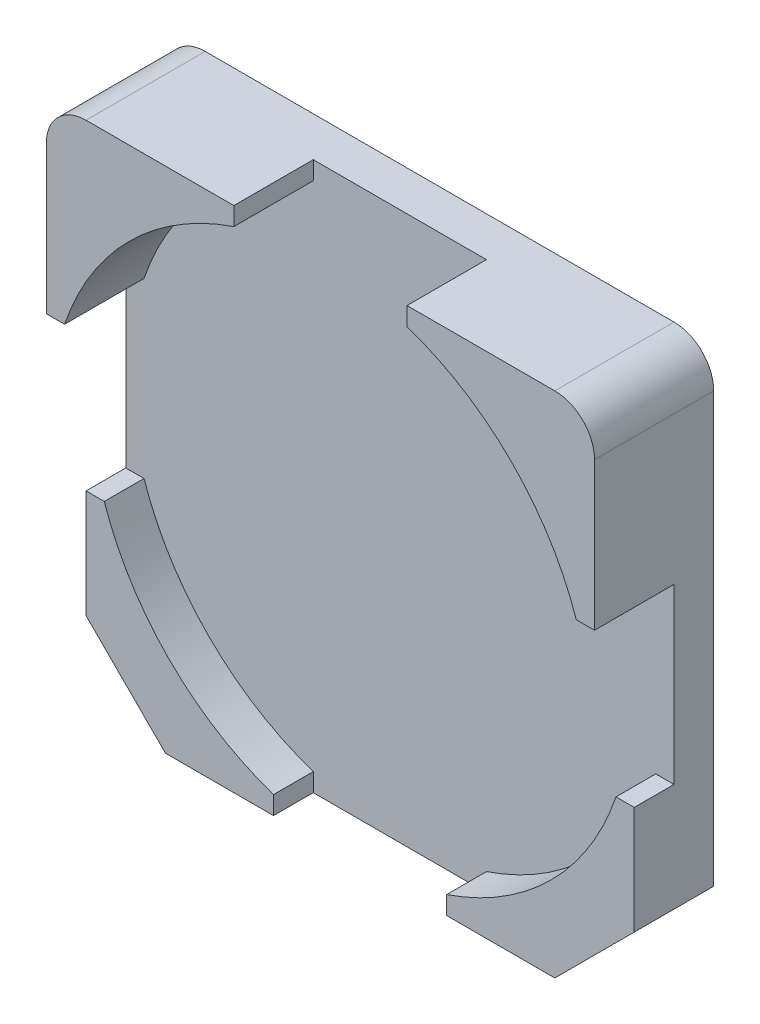
ISO-10303-21;
HEADER;
FILE_DESCRIPTION(('STEP AP214'),'2;1');
FILE_NAME('part.step','',(''),(''),'','','');
FILE_SCHEMA(('AUTOMOTIVE_DESIGN { 1 0 10303 214 1 1 1 1 }'));
ENDSEC;
DATA;
#1=APPLICATION_CONTEXT('core data for automotive mechanical design processes');
#2=APPLICATION_PROTOCOL_DEFINITION('international standard','automotive_design',2000,#1);
#3=PRODUCT_CONTEXT('',#1,'mechanical');
#4=PRODUCT('Part','Part','',(#3));
#5=PRODUCT_RELATED_PRODUCT_CATEGORY('part','',(#4));
#6=PRODUCT_DEFINITION_FORMATION('','',#4);
#7=PRODUCT_DEFINITION_CONTEXT('part definition',#1,'design');
#8=PRODUCT_DEFINITION('design','',#6,#7);
#9=PRODUCT_DEFINITION_SHAPE('','',#8);
#10=(LENGTH_UNIT() NAMED_UNIT(*) SI_UNIT(.MILLI.,.METRE.));
#11=(NAMED_UNIT(*) PLANE_ANGLE_UNIT() SI_UNIT($,.RADIAN.));
#12=(NAMED_UNIT(*) SI_UNIT($,.STERADIAN.) SOLID_ANGLE_UNIT());
#13=UNCERTAINTY_MEASURE_WITH_UNIT(LENGTH_MEASURE(1.E-05),#10,'distance_accuracy_value','');
#14=(GEOMETRIC_REPRESENTATION_CONTEXT(3) GLOBAL_UNCERTAINTY_ASSIGNED_CONTEXT((#13)) GLOBAL_UNIT_ASSIGNED_CONTEXT((#10,
#11,#12)) REPRESENTATION_CONTEXT('',''));
#15=CARTESIAN_POINT('',(0.,0.,0.));
#16=DIRECTION('',(0.,0.,1.));
#17=DIRECTION('',(1.,0.,0.));
#18=AXIS2_PLACEMENT_3D('',#15,#16,#17);
#19=CARTESIAN_POINT('',(3.45,3.45,0.5));
#20=DIRECTION('',(0.,0.,1.));
#21=DIRECTION('',(1.,0.,0.));
#22=AXIS2_PLACEMENT_3D('',#19,#20,#21);
#23=CYLINDRICAL_SURFACE('',#22,3.4);
#24=CARTESIAN_POINT('',(3.45,3.45,1.));
#25=DIRECTION('',(0.,0.,1.));
#26=DIRECTION('',(1.,0.,0.));
#27=AXIS2_PLACEMENT_3D('',#24,#25,#26);
#28=CIRCLE('',#27,3.4);
#29=CARTESIAN_POINT('',(6.67042122355026,2.35963898505721,1.));
#30=VERTEX_POINT('',#29);
#31=CARTESIAN_POINT('',(4.54,0.229456567596084,1.));
#32=VERTEX_POINT('',#31);
#33=EDGE_CURVE('E344',#30,#32,#28,.F.);
#34=ORIENTED_EDGE('',*,*,#33,.F.);
#35=DIRECTION('',(0.,0.,1.));
#36=VECTOR('',#35,1.);
#37=CARTESIAN_POINT('',(6.67042122355026,2.35963898505721,0.5));
#38=LINE('',#37,#36);
#39=CARTESIAN_POINT('',(6.67042122355026,2.35963898505721,0.5));
#40=VERTEX_POINT('',#39);
#41=EDGE_CURVE('E211',#30,#40,#38,.F.);
#42=ORIENTED_EDGE('',*,*,#41,.T.);
#43=CARTESIAN_POINT('',(3.45,3.45,0.5));
#44=DIRECTION('',(0.,0.,1.));
#45=DIRECTION('',(1.,0.,0.));
#46=AXIS2_PLACEMENT_3D('',#43,#44,#45);
#47=CIRCLE('',#46,3.4);
#48=CARTESIAN_POINT('',(4.54,0.229456567596084,0.5));
#49=VERTEX_POINT('',#48);
#50=EDGE_CURVE('E262',#49,#40,#47,.T.);
#51=ORIENTED_EDGE('',*,*,#50,.F.);
#52=DIRECTION('',(0.,0.,1.));
#53=VECTOR('',#52,1.);
#54=CARTESIAN_POINT('',(4.54,0.229456567596084,0.5));
#55=LINE('',#54,#53);
#56=EDGE_CURVE('E240',#49,#32,#55,.T.);
#57=ORIENTED_EDGE('',*,*,#56,.T.);
#58=EDGE_LOOP('',(#34,#42,#51,#57));
#59=FACE_BOUND('',#58,.T.);
#60=ADVANCED_FACE('F30',(#59),#23,.F.);
#61=CARTESIAN_POINT('',(0.,0.,1.5));
#62=DIRECTION('',(1.,0.,0.));
#63=DIRECTION('',(0.,0.,-1.));
#64=AXIS2_PLACEMENT_3D('',#61,#62,#63);
#65=PLANE('',#64);
#66=DIRECTION('',(0.,-1.,0.));
#67=VECTOR('',#66,1.);
#68=CARTESIAN_POINT('',(0.,0.,1.5));
#69=LINE('',#68,#67);
#70=CARTESIAN_POINT('',(0.,6.4,1.5));
#71=VERTEX_POINT('',#70);
#72=CARTESIAN_POINT('',(0.,4.54036101494279,1.5));
#73=VERTEX_POINT('',#72);
#74=EDGE_CURVE('E266',#71,#73,#69,.T.);
#75=ORIENTED_EDGE('',*,*,#74,.F.);
#76=DIRECTION('',(0.,0.,-1.));
#77=VECTOR('',#76,1.);
#78=CARTESIAN_POINT('',(0.,6.4,1.5));
#79=LINE('',#78,#77);
#80=CARTESIAN_POINT('',(0.,6.4,0.));
#81=VERTEX_POINT('',#80);
#82=EDGE_CURVE('E38',#71,#81,#79,.T.);
#83=ORIENTED_EDGE('',*,*,#82,.T.);
#84=DIRECTION('',(0.,-1.,0.));
#85=VECTOR('',#84,1.);
#86=CARTESIAN_POINT('',(0.,0.,0.));
#87=LINE('',#86,#85);
#88=CARTESIAN_POINT('',(0.,1.,0.));
#89=VERTEX_POINT('',#88);
#90=EDGE_CURVE('E260',#81,#89,#87,.T.);
#91=ORIENTED_EDGE('',*,*,#90,.T.);
#92=DIRECTION('',(0.,0.,1.));
#93=VECTOR('',#92,1.);
#94=CARTESIAN_POINT('',(0.,1.,1.5));
#95=LINE('',#94,#93);
#96=CARTESIAN_POINT('',(0.,1.00000000000001,1.));
#97=VERTEX_POINT('',#96);
#98=EDGE_CURVE('E294',#89,#97,#95,.T.);
#99=ORIENTED_EDGE('',*,*,#98,.T.);
#100=DIRECTION('',(0.,-1.,0.));
#101=VECTOR('',#100,1.);
#102=CARTESIAN_POINT('',(0.,0.,1.));
#103=LINE('',#102,#101);
#104=CARTESIAN_POINT('',(0.,2.35963898505721,1.));
#105=VERTEX_POINT('',#104);
#106=EDGE_CURVE('E212',#105,#97,#103,.T.);
#107=ORIENTED_EDGE('',*,*,#106,.F.);
#108=DIRECTION('',(0.,0.,1.));
#109=VECTOR('',#108,1.);
#110=CARTESIAN_POINT('',(0.,2.35963898505721,0.5));
#111=LINE('',#110,#109);
#112=CARTESIAN_POINT('',(0.,2.35963898505721,0.5));
#113=VERTEX_POINT('',#112);
#114=EDGE_CURVE('E230',#113,#105,#111,.T.);
#115=ORIENTED_EDGE('',*,*,#114,.F.);
#116=DIRECTION('',(0.,-1.,0.));
#117=VECTOR('',#116,1.);
#118=CARTESIAN_POINT('',(0.,4.54036101494279,0.5));
#119=LINE('',#118,#117);
#120=CARTESIAN_POINT('',(0.,4.54036101494279,0.5));
#121=VERTEX_POINT('',#120);
#122=EDGE_CURVE('E347',#121,#113,#119,.T.);
#123=ORIENTED_EDGE('',*,*,#122,.F.);
#124=DIRECTION('',(0.,0.,1.));
#125=VECTOR('',#124,1.);
#126=CARTESIAN_POINT('',(0.,4.54036101494279,0.5));
#127=LINE('',#126,#125);
#128=EDGE_CURVE('E238',#121,#73,#127,.T.);
#129=ORIENTED_EDGE('',*,*,#128,.T.);
#130=EDGE_LOOP('',(#75,#83,#91,#99,#107,#115,#123,#129));
#131=FACE_BOUND('',#130,.T.);
#132=ADVANCED_FACE('F316',(#131),#65,.F.);
#133=CARTESIAN_POINT('',(0.,0.,1.5));
#134=DIRECTION('',(0.,1.,0.));
#135=DIRECTION('',(0.,0.,1.));
#136=AXIS2_PLACEMENT_3D('',#133,#134,#135);
#137=PLANE('',#136);
#138=DIRECTION('',(1.,0.,0.));
#139=VECTOR('',#138,1.);
#140=CARTESIAN_POINT('',(6.9,0.,1.));
#141=LINE('',#140,#139);
#142=CARTESIAN_POINT('',(1.,0.,1.));
#143=VERTEX_POINT('',#142);
#144=CARTESIAN_POINT('',(2.36,0.,1.));
#145=VERTEX_POINT('',#144);
#146=EDGE_CURVE('E337',#143,#145,#141,.T.);
#147=ORIENTED_EDGE('',*,*,#146,.F.);
#148=DIRECTION('',(0.,0.,-1.));
#149=VECTOR('',#148,1.);
#150=CARTESIAN_POINT('',(1.,0.,1.5));
#151=LINE('',#150,#149);
#152=CARTESIAN_POINT('',(1.,0.,0.));
#153=VERTEX_POINT('',#152);
#154=EDGE_CURVE('E286',#143,#153,#151,.T.);
#155=ORIENTED_EDGE('',*,*,#154,.T.);
#156=DIRECTION('',(1.,0.,0.));
#157=VECTOR('',#156,1.);
#158=CARTESIAN_POINT('',(0.,0.,0.));
#159=LINE('',#158,#157);
#160=CARTESIAN_POINT('',(5.9,0.,0.));
#161=VERTEX_POINT('',#160);
#162=EDGE_CURVE('E276',#153,#161,#159,.T.);
#163=ORIENTED_EDGE('',*,*,#162,.T.);
#164=DIRECTION('',(0.,0.,1.));
#165=VECTOR('',#164,1.);
#166=CARTESIAN_POINT('',(5.9,0.,1.5));
#167=LINE('',#166,#165);
#168=CARTESIAN_POINT('',(5.9,0.,1.));
#169=VERTEX_POINT('',#168);
#170=EDGE_CURVE('E284',#161,#169,#167,.T.);
#171=ORIENTED_EDGE('',*,*,#170,.T.);
#172=CARTESIAN_POINT('',(4.54,0.,1.));
#173=VERTEX_POINT('',#172);
#174=EDGE_CURVE('E335',#173,#169,#141,.T.);
#175=ORIENTED_EDGE('',*,*,#174,.F.);
#176=DIRECTION('',(0.,0.,1.));
#177=VECTOR('',#176,1.);
#178=CARTESIAN_POINT('',(4.54,0.,0.5));
#179=LINE('',#178,#177);
#180=CARTESIAN_POINT('',(4.54,0.,0.5));
#181=VERTEX_POINT('',#180);
#182=EDGE_CURVE('E219',#181,#173,#179,.T.);
#183=ORIENTED_EDGE('',*,*,#182,.F.);
#184=DIRECTION('',(1.,0.,0.));
#185=VECTOR('',#184,1.);
#186=CARTESIAN_POINT('',(2.36,0.,0.5));
#187=LINE('',#186,#185);
#188=CARTESIAN_POINT('',(2.36,0.,0.5));
#189=VERTEX_POINT('',#188);
#190=EDGE_CURVE('E355',#189,#181,#187,.T.);
#191=ORIENTED_EDGE('',*,*,#190,.F.);
#192=DIRECTION('',(0.,0.,1.));
#193=VECTOR('',#192,1.);
#194=CARTESIAN_POINT('',(2.36,0.,0.5));
#195=LINE('',#194,#193);
#196=EDGE_CURVE('E224',#189,#145,#195,.T.);
#197=ORIENTED_EDGE('',*,*,#196,.T.);
#198=EDGE_LOOP('',(#147,#155,#163,#171,#175,#183,#191,#197));
#199=FACE_BOUND('',#198,.T.);
#200=ADVANCED_FACE('F413',(#199),#137,.F.);
#201=CARTESIAN_POINT('',(6.9,0.,1.5));
#202=DIRECTION('',(-1.,0.,0.));
#203=DIRECTION('',(0.,0.,1.));
#204=AXIS2_PLACEMENT_3D('',#201,#202,#203);
#205=PLANE('',#204);
#206=DIRECTION('',(0.,1.,0.));
#207=VECTOR('',#206,1.);
#208=CARTESIAN_POINT('',(6.9,0.,0.));
#209=LINE('',#208,#207);
#210=CARTESIAN_POINT('',(6.9,1.,0.));
#211=VERTEX_POINT('',#210);
#212=CARTESIAN_POINT('',(6.9,6.4,0.));
#213=VERTEX_POINT('',#212);
#214=EDGE_CURVE('E279',#211,#213,#209,.T.);
#215=ORIENTED_EDGE('',*,*,#214,.T.);
#216=DIRECTION('',(0.,0.,-1.));
#217=VECTOR('',#216,1.);
#218=CARTESIAN_POINT('',(6.9,6.4,1.5));
#219=LINE('',#218,#217);
#220=CARTESIAN_POINT('',(6.9,6.4,1.5));
#221=VERTEX_POINT('',#220);
#222=EDGE_CURVE('E51',#213,#221,#219,.F.);
#223=ORIENTED_EDGE('',*,*,#222,.T.);
#224=DIRECTION('',(0.,1.,0.));
#225=VECTOR('',#224,1.);
#226=CARTESIAN_POINT('',(6.9,0.,1.5));
#227=LINE('',#226,#225);
#228=CARTESIAN_POINT('',(6.9,4.54036101494279,1.5));
#229=VERTEX_POINT('',#228);
#230=EDGE_CURVE('E268',#229,#221,#227,.T.);
#231=ORIENTED_EDGE('',*,*,#230,.F.);
#232=DIRECTION('',(0.,0.,1.));
#233=VECTOR('',#232,1.);
#234=CARTESIAN_POINT('',(6.9,4.54036101494279,0.5));
#235=LINE('',#234,#233);
#236=CARTESIAN_POINT('',(6.9,4.54036101494279,0.5));
#237=VERTEX_POINT('',#236);
#238=EDGE_CURVE('E218',#237,#229,#235,.T.);
#239=ORIENTED_EDGE('',*,*,#238,.F.);
#240=DIRECTION('',(0.,1.,0.));
#241=VECTOR('',#240,1.);
#242=CARTESIAN_POINT('',(6.9,4.54036101494279,0.5));
#243=LINE('',#242,#241);
#244=CARTESIAN_POINT('',(6.9,2.35963898505721,0.5));
#245=VERTEX_POINT('',#244);
#246=EDGE_CURVE('E217',#245,#237,#243,.T.);
#247=ORIENTED_EDGE('',*,*,#246,.F.);
#248=DIRECTION('',(0.,0.,1.));
#249=VECTOR('',#248,1.);
#250=CARTESIAN_POINT('',(6.9,2.35963898505721,0.5));
#251=LINE('',#250,#249);
#252=CARTESIAN_POINT('',(6.9,2.35963898505721,1.));
#253=VERTEX_POINT('',#252);
#254=EDGE_CURVE('E209',#245,#253,#251,.T.);
#255=ORIENTED_EDGE('',*,*,#254,.T.);
#256=DIRECTION('',(0.,1.,0.));
#257=VECTOR('',#256,1.);
#258=CARTESIAN_POINT('',(6.9,0.,1.));
#259=LINE('',#258,#257);
#260=CARTESIAN_POINT('',(6.9,1.,1.));
#261=VERTEX_POINT('',#260);
#262=EDGE_CURVE('E191',#261,#253,#259,.T.);
#263=ORIENTED_EDGE('',*,*,#262,.F.);
#264=DIRECTION('',(0.,0.,-1.));
#265=VECTOR('',#264,1.);
#266=CARTESIAN_POINT('',(6.9,1.,1.5));
#267=LINE('',#266,#265);
#268=EDGE_CURVE('E298',#261,#211,#267,.T.);
#269=ORIENTED_EDGE('',*,*,#268,.T.);
#270=EDGE_LOOP('',(#215,#223,#231,#239,#247,#255,#263,#269));
#271=FACE_BOUND('',#270,.T.);
#272=ADVANCED_FACE('F214',(#271),#205,.F.);
#273=CARTESIAN_POINT('',(3.45,3.45,1.));
#274=DIRECTION('',(0.,0.,1.));
#275=DIRECTION('',(1.,0.,0.));
#276=AXIS2_PLACEMENT_3D('',#273,#274,#275);
#277=CIRCLE('',#276,3.4);
#278=CARTESIAN_POINT('',(2.36,0.229456567596085,1.));
#279=VERTEX_POINT('',#278);
#280=CARTESIAN_POINT('',(0.229578776449743,2.35963898505721,1.));
#281=VERTEX_POINT('',#280);
#282=EDGE_CURVE('E340',#279,#281,#277,.F.);
#283=ORIENTED_EDGE('',*,*,#282,.F.);
#284=DIRECTION('',(0.,0.,1.));
#285=VECTOR('',#284,1.);
#286=CARTESIAN_POINT('',(2.36,0.229456567596085,0.5));
#287=LINE('',#286,#285);
#288=CARTESIAN_POINT('',(2.36,0.229456567596085,0.5));
#289=VERTEX_POINT('',#288);
#290=EDGE_CURVE('E237',#279,#289,#287,.F.);
#291=ORIENTED_EDGE('',*,*,#290,.T.);
#292=CARTESIAN_POINT('',(0.229578776449744,2.35963898505721,0.5));
#293=VERTEX_POINT('',#292);
#294=EDGE_CURVE('E427',#293,#289,#47,.T.);
#295=ORIENTED_EDGE('',*,*,#294,.F.);
#296=DIRECTION('',(0.,0.,1.));
#297=VECTOR('',#296,1.);
#298=CARTESIAN_POINT('',(0.229578776449744,2.35963898505721,0.5));
#299=LINE('',#298,#297);
#300=EDGE_CURVE('E234',#293,#281,#299,.T.);
#301=ORIENTED_EDGE('',*,*,#300,.T.);
#302=EDGE_LOOP('',(#283,#291,#295,#301));
#303=FACE_BOUND('',#302,.T.);
#304=ADVANCED_FACE('F426',(#303),#23,.F.);
#305=CARTESIAN_POINT('',(4.54,2.35963898505721,0.5));
#306=DIRECTION('',(0.,-1.,0.));
#307=DIRECTION('',(1.,0.,0.));
#308=AXIS2_PLACEMENT_3D('',#305,#306,#307);
#309=PLANE('',#308);
#310=DIRECTION('',(-1.,0.,0.));
#311=VECTOR('',#310,1.);
#312=CARTESIAN_POINT('',(6.9,2.35963898505721,1.));
#313=LINE('',#312,#311);
#314=EDGE_CURVE('E195',#253,#30,#313,.T.);
#315=ORIENTED_EDGE('',*,*,#314,.F.);
#316=ORIENTED_EDGE('',*,*,#254,.F.);
#317=DIRECTION('',(1.,0.,0.));
#318=VECTOR('',#317,1.);
#319=CARTESIAN_POINT('',(4.54,2.35963898505721,0.5));
#320=LINE('',#319,#318);
#321=EDGE_CURVE('E360',#40,#245,#320,.T.);
#322=ORIENTED_EDGE('',*,*,#321,.F.);
#323=ORIENTED_EDGE('',*,*,#41,.F.);
#324=EDGE_LOOP('',(#315,#316,#322,#323));
#325=FACE_BOUND('',#324,.T.);
#326=ADVANCED_FACE('F207',(#325),#309,.F.);
#327=CARTESIAN_POINT('',(0.,2.35963898505721,0.5));
#328=DIRECTION('',(0.,-1.,0.));
#329=DIRECTION('',(1.,0.,0.));
#330=AXIS2_PLACEMENT_3D('',#327,#328,#329);
#331=PLANE('',#330);
#332=EDGE_CURVE('E202',#281,#105,#313,.T.);
#333=ORIENTED_EDGE('',*,*,#332,.F.);
#334=ORIENTED_EDGE('',*,*,#300,.F.);
#335=DIRECTION('',(1.,0.,0.));
#336=VECTOR('',#335,1.);
#337=CARTESIAN_POINT('',(0.,2.35963898505721,0.5));
#338=LINE('',#337,#336);
#339=EDGE_CURVE('E350',#113,#293,#338,.T.);
#340=ORIENTED_EDGE('',*,*,#339,.F.);
#341=ORIENTED_EDGE('',*,*,#114,.T.);
#342=EDGE_LOOP('',(#333,#334,#340,#341));
#343=FACE_BOUND('',#342,.T.);
#344=ADVANCED_FACE('F430',(#343),#331,.F.);
#345=CARTESIAN_POINT('',(4.54,0.,0.5));
#346=DIRECTION('',(1.,0.,0.));
#347=DIRECTION('',(0.,0.,-1.));
#348=AXIS2_PLACEMENT_3D('',#345,#346,#347);
#349=PLANE('',#348);
#350=DIRECTION('',(0.,-1.,0.));
#351=VECTOR('',#350,1.);
#352=CARTESIAN_POINT('',(4.54,0.,1.));
#353=LINE('',#352,#351);
#354=EDGE_CURVE('E342',#32,#173,#353,.T.);
#355=ORIENTED_EDGE('',*,*,#354,.F.);
#356=ORIENTED_EDGE('',*,*,#56,.F.);
#357=DIRECTION('',(0.,1.,0.));
#358=VECTOR('',#357,1.);
#359=CARTESIAN_POINT('',(4.54,0.,0.5));
#360=LINE('',#359,#358);
#361=EDGE_CURVE('E358',#181,#49,#360,.T.);
#362=ORIENTED_EDGE('',*,*,#361,.F.);
#363=ORIENTED_EDGE('',*,*,#182,.T.);
#364=EDGE_LOOP('',(#355,#356,#362,#363));
#365=FACE_BOUND('',#364,.T.);
#366=ADVANCED_FACE('F585',(#365),#349,.F.);
#367=CARTESIAN_POINT('',(2.36,0.,0.5));
#368=DIRECTION('',(-1.,0.,0.));
#369=DIRECTION('',(0.,0.,1.));
#370=AXIS2_PLACEMENT_3D('',#367,#368,#369);
#371=PLANE('',#370);
#372=DIRECTION('',(0.,1.,0.));
#373=VECTOR('',#372,1.);
#374=CARTESIAN_POINT('',(2.36,0.,1.));
#375=LINE('',#374,#373);
#376=EDGE_CURVE('E274',#145,#279,#375,.T.);
#377=ORIENTED_EDGE('',*,*,#376,.F.);
#378=ORIENTED_EDGE('',*,*,#196,.F.);
#379=DIRECTION('',(0.,-1.,0.));
#380=VECTOR('',#379,1.);
#381=CARTESIAN_POINT('',(2.36,0.,0.5));
#382=LINE('',#381,#380);
#383=EDGE_CURVE('E353',#289,#189,#382,.T.);
#384=ORIENTED_EDGE('',*,*,#383,.F.);
#385=ORIENTED_EDGE('',*,*,#290,.F.);
#386=EDGE_LOOP('',(#377,#378,#384,#385));
#387=FACE_BOUND('',#386,.T.);
#388=ADVANCED_FACE('F421',(#387),#371,.F.);
#389=CARTESIAN_POINT('',(0.,6.9,1.5));
#390=DIRECTION('',(0.,0.,-1.));
#391=DIRECTION('',(-1.,0.,0.));
#392=AXIS2_PLACEMENT_3D('',#389,#390,#391);
#393=PLANE('',#392);
#394=DIRECTION('',(-1.,0.,0.));
#395=VECTOR('',#394,1.);
#396=CARTESIAN_POINT('',(0.,6.9,1.5));
#397=LINE('',#396,#395);
#398=CARTESIAN_POINT('',(2.36,6.9,1.5));
#399=VERTEX_POINT('',#398);
#400=CARTESIAN_POINT('',(0.5,6.9,1.5));
#401=VERTEX_POINT('',#400);
#402=EDGE_CURVE('E271',#399,#401,#397,.T.);
#403=ORIENTED_EDGE('',*,*,#402,.T.);
#404=CARTESIAN_POINT('',(0.5,6.4,1.5));
#405=DIRECTION('',(0.,0.,-1.));
#406=DIRECTION('',(-1.,0.,0.));
#407=AXIS2_PLACEMENT_3D('',#404,#405,#406);
#408=CIRCLE('',#407,0.5);
#409=EDGE_CURVE('E11',#401,#71,#408,.F.);
#410=ORIENTED_EDGE('',*,*,#409,.T.);
#411=ORIENTED_EDGE('',*,*,#74,.T.);
#412=DIRECTION('',(-1.,0.,0.));
#413=VECTOR('',#412,1.);
#414=CARTESIAN_POINT('',(0.,4.54036101494279,1.5));
#415=LINE('',#414,#413);
#416=CARTESIAN_POINT('',(0.229578776449744,4.54036101494279,1.5));
#417=VERTEX_POINT('',#416);
#418=EDGE_CURVE('E351',#417,#73,#415,.T.);
#419=ORIENTED_EDGE('',*,*,#418,.F.);
#420=CARTESIAN_POINT('',(3.45,3.45,1.5));
#421=DIRECTION('',(0.,0.,1.));
#422=DIRECTION('',(1.,0.,0.));
#423=AXIS2_PLACEMENT_3D('',#420,#421,#422);
#424=CIRCLE('',#423,3.4);
#425=CARTESIAN_POINT('',(2.36,6.67054343240392,1.5));
#426=VERTEX_POINT('',#425);
#427=EDGE_CURVE('E256',#426,#417,#424,.T.);
#428=ORIENTED_EDGE('',*,*,#427,.F.);
#429=DIRECTION('',(0.,-1.,0.));
#430=VECTOR('',#429,1.);
#431=CARTESIAN_POINT('',(2.36,4.54036101494279,1.5));
#432=LINE('',#431,#430);
#433=EDGE_CURVE('E377',#399,#426,#432,.T.);
#434=ORIENTED_EDGE('',*,*,#433,.F.);
#435=EDGE_LOOP('',(#403,#410,#411,#419,#428,#434));
#436=FACE_BOUND('',#435,.T.);
#437=ADVANCED_FACE('F442',(#436),#393,.F.);
#438=ORIENTED_EDGE('',*,*,#230,.T.);
#439=CARTESIAN_POINT('',(6.4,6.4,1.5));
#440=DIRECTION('',(0.,0.,-1.));
#441=DIRECTION('',(-1.,0.,0.));
#442=AXIS2_PLACEMENT_3D('',#439,#440,#441);
#443=CIRCLE('',#442,0.5);
#444=CARTESIAN_POINT('',(6.4,6.9,1.5));
#445=VERTEX_POINT('',#444);
#446=EDGE_CURVE('E311',#221,#445,#443,.F.);
#447=ORIENTED_EDGE('',*,*,#446,.T.);
#448=CARTESIAN_POINT('',(4.54,6.9,1.5));
#449=VERTEX_POINT('',#448);
#450=EDGE_CURVE('E272',#445,#449,#397,.T.);
#451=ORIENTED_EDGE('',*,*,#450,.T.);
#452=DIRECTION('',(0.,1.,0.));
#453=VECTOR('',#452,1.);
#454=CARTESIAN_POINT('',(4.54,4.54036101494279,1.5));
#455=LINE('',#454,#453);
#456=CARTESIAN_POINT('',(4.54,6.67054343240392,1.5));
#457=VERTEX_POINT('',#456);
#458=EDGE_CURVE('E374',#457,#449,#455,.T.);
#459=ORIENTED_EDGE('',*,*,#458,.F.);
#460=CARTESIAN_POINT('',(6.67042122355026,4.54036101494279,1.5));
#461=VERTEX_POINT('',#460);
#462=EDGE_CURVE('E263',#461,#457,#424,.T.);
#463=ORIENTED_EDGE('',*,*,#462,.F.);
#464=DIRECTION('',(-1.,0.,0.));
#465=VECTOR('',#464,1.);
#466=CARTESIAN_POINT('',(4.54,4.54036101494279,1.5));
#467=LINE('',#466,#465);
#468=EDGE_CURVE('E346',#229,#461,#467,.T.);
#469=ORIENTED_EDGE('',*,*,#468,.F.);
#470=EDGE_LOOP('',(#438,#447,#451,#459,#463,#469));
#471=FACE_BOUND('',#470,.T.);
#472=ADVANCED_FACE('F396',(#471),#393,.F.);
#473=ORIENTED_EDGE('',*,*,#427,.T.);
#474=DIRECTION('',(0.,0.,1.));
#475=VECTOR('',#474,1.);
#476=CARTESIAN_POINT('',(0.229578776449744,4.54036101494279,0.5));
#477=LINE('',#476,#475);
#478=CARTESIAN_POINT('',(0.229578776449744,4.54036101494279,0.5));
#479=VERTEX_POINT('',#478);
#480=EDGE_CURVE('E253',#417,#479,#477,.F.);
#481=ORIENTED_EDGE('',*,*,#480,.T.);
#482=CARTESIAN_POINT('',(2.36,6.67054343240392,0.5));
#483=VERTEX_POINT('',#482);
#484=EDGE_CURVE('E261',#483,#479,#47,.T.);
#485=ORIENTED_EDGE('',*,*,#484,.F.);
#486=DIRECTION('',(0.,0.,1.));
#487=VECTOR('',#486,1.);
#488=CARTESIAN_POINT('',(2.36,6.67054343240392,0.5));
#489=LINE('',#488,#487);
#490=EDGE_CURVE('E250',#483,#426,#489,.T.);
#491=ORIENTED_EDGE('',*,*,#490,.T.);
#492=EDGE_LOOP('',(#473,#481,#485,#491));
#493=FACE_BOUND('',#492,.T.);
#494=ADVANCED_FACE('F445',(#493),#23,.F.);
#495=ORIENTED_EDGE('',*,*,#462,.T.);
#496=DIRECTION('',(0.,0.,1.));
#497=VECTOR('',#496,1.);
#498=CARTESIAN_POINT('',(4.54,6.67054343240392,0.5));
#499=LINE('',#498,#497);
#500=CARTESIAN_POINT('',(4.54,6.67054343240392,0.5));
#501=VERTEX_POINT('',#500);
#502=EDGE_CURVE('E247',#457,#501,#499,.F.);
#503=ORIENTED_EDGE('',*,*,#502,.T.);
#504=CARTESIAN_POINT('',(6.67042122355026,4.54036101494279,0.5));
#505=VERTEX_POINT('',#504);
#506=EDGE_CURVE('E257',#505,#501,#47,.T.);
#507=ORIENTED_EDGE('',*,*,#506,.F.);
#508=DIRECTION('',(0.,0.,1.));
#509=VECTOR('',#508,1.);
#510=CARTESIAN_POINT('',(6.67042122355026,4.54036101494279,0.5));
#511=LINE('',#510,#509);
#512=EDGE_CURVE('E244',#505,#461,#511,.T.);
#513=ORIENTED_EDGE('',*,*,#512,.T.);
#514=EDGE_LOOP('',(#495,#503,#507,#513));
#515=FACE_BOUND('',#514,.T.);
#516=ADVANCED_FACE('F399',(#515),#23,.F.);
#517=CARTESIAN_POINT('',(0.,6.9,1.5));
#518=DIRECTION('',(0.,-1.,0.));
#519=DIRECTION('',(0.,0.,-1.));
#520=AXIS2_PLACEMENT_3D('',#517,#518,#519);
#521=PLANE('',#520);
#522=ORIENTED_EDGE('',*,*,#450,.F.);
#523=DIRECTION('',(0.,0.,-1.));
#524=VECTOR('',#523,1.);
#525=CARTESIAN_POINT('',(6.4,6.9,1.5));
#526=LINE('',#525,#524);
#527=CARTESIAN_POINT('',(6.4,6.9,0.));
#528=VERTEX_POINT('',#527);
#529=EDGE_CURVE('E303',#445,#528,#526,.T.);
#530=ORIENTED_EDGE('',*,*,#529,.T.);
#531=DIRECTION('',(-1.,0.,0.));
#532=VECTOR('',#531,1.);
#533=CARTESIAN_POINT('',(0.,6.9,0.));
#534=LINE('',#533,#532);
#535=CARTESIAN_POINT('',(0.5,6.9,0.));
#536=VERTEX_POINT('',#535);
#537=EDGE_CURVE('E269',#528,#536,#534,.T.);
#538=ORIENTED_EDGE('',*,*,#537,.T.);
#539=DIRECTION('',(0.,0.,-1.));
#540=VECTOR('',#539,1.);
#541=CARTESIAN_POINT('',(0.5,6.9,1.5));
#542=LINE('',#541,#540);
#543=EDGE_CURVE('E301',#536,#401,#542,.F.);
#544=ORIENTED_EDGE('',*,*,#543,.T.);
#545=ORIENTED_EDGE('',*,*,#402,.F.);
#546=DIRECTION('',(0.,0.,1.));
#547=VECTOR('',#546,1.);
#548=CARTESIAN_POINT('',(2.36,6.9,0.5));
#549=LINE('',#548,#547);
#550=CARTESIAN_POINT('',(2.36,6.9,0.5));
#551=VERTEX_POINT('',#550);
#552=EDGE_CURVE('E382',#551,#399,#549,.T.);
#553=ORIENTED_EDGE('',*,*,#552,.F.);
#554=DIRECTION('',(-1.,0.,0.));
#555=VECTOR('',#554,1.);
#556=CARTESIAN_POINT('',(2.36,6.9,0.5));
#557=LINE('',#556,#555);
#558=CARTESIAN_POINT('',(4.54,6.9,0.5));
#559=VERTEX_POINT('',#558);
#560=EDGE_CURVE('E367',#559,#551,#557,.T.);
#561=ORIENTED_EDGE('',*,*,#560,.F.);
#562=DIRECTION('',(0.,0.,1.));
#563=VECTOR('',#562,1.);
#564=CARTESIAN_POINT('',(4.54,6.9,0.5));
#565=LINE('',#564,#563);
#566=EDGE_CURVE('E221',#559,#449,#565,.T.);
#567=ORIENTED_EDGE('',*,*,#566,.T.);
#568=EDGE_LOOP('',(#522,#530,#538,#544,#545,#553,#561,#567));
#569=FACE_BOUND('',#568,.T.);
#570=ADVANCED_FACE('F388',(#569),#521,.F.);
#571=CARTESIAN_POINT('',(0.,6.9,0.));
#572=DIRECTION('',(0.,0.,-1.));
#573=DIRECTION('',(-1.,0.,0.));
#574=AXIS2_PLACEMENT_3D('',#571,#572,#573);
#575=PLANE('',#574);
#576=ORIENTED_EDGE('',*,*,#537,.F.);
#577=CARTESIAN_POINT('',(6.4,6.4,0.));
#578=DIRECTION('',(0.,0.,-1.));
#579=DIRECTION('',(-1.,0.,0.));
#580=AXIS2_PLACEMENT_3D('',#577,#578,#579);
#581=CIRCLE('',#580,0.5);
#582=EDGE_CURVE('E308',#528,#213,#581,.T.);
#583=ORIENTED_EDGE('',*,*,#582,.T.);
#584=ORIENTED_EDGE('',*,*,#214,.F.);
#585=DIRECTION('',(0.707106781186548,0.707106781186547,0.));
#586=VECTOR('',#585,1.);
#587=CARTESIAN_POINT('',(6.39999999999999,0.499999999999994,0.));
#588=LINE('',#587,#586);
#589=EDGE_CURVE('E289',#211,#161,#588,.F.);
#590=ORIENTED_EDGE('',*,*,#589,.T.);
#591=ORIENTED_EDGE('',*,*,#162,.F.);
#592=DIRECTION('',(0.707106781186547,-0.707106781186548,0.));
#593=VECTOR('',#592,1.);
#594=CARTESIAN_POINT('',(-2.95,3.95000000000001,0.));
#595=LINE('',#594,#593);
#596=EDGE_CURVE('E291',#153,#89,#595,.F.);
#597=ORIENTED_EDGE('',*,*,#596,.T.);
#598=ORIENTED_EDGE('',*,*,#90,.F.);
#599=CARTESIAN_POINT('',(0.5,6.4,0.));
#600=DIRECTION('',(0.,0.,-1.));
#601=DIRECTION('',(-1.,0.,0.));
#602=AXIS2_PLACEMENT_3D('',#599,#600,#601);
#603=CIRCLE('',#602,0.5);
#604=EDGE_CURVE('E306',#81,#536,#603,.T.);
#605=ORIENTED_EDGE('',*,*,#604,.T.);
#606=EDGE_LOOP('',(#576,#583,#584,#590,#591,#597,#598,#605));
#607=FACE_BOUND('',#606,.T.);
#608=ADVANCED_FACE('F321',(#607),#575,.T.);
#609=CARTESIAN_POINT('',(3.45,3.45,0.5));
#610=DIRECTION('',(0.,0.,1.));
#611=DIRECTION('',(1.,0.,0.));
#612=AXIS2_PLACEMENT_3D('',#609,#610,#611);
#613=PLANE('',#612);
#614=ORIENTED_EDGE('',*,*,#484,.T.);
#615=DIRECTION('',(-1.,0.,0.));
#616=VECTOR('',#615,1.);
#617=CARTESIAN_POINT('',(0.,4.54036101494279,0.5));
#618=LINE('',#617,#616);
#619=EDGE_CURVE('E233',#479,#121,#618,.T.);
#620=ORIENTED_EDGE('',*,*,#619,.T.);
#621=ORIENTED_EDGE('',*,*,#122,.T.);
#622=ORIENTED_EDGE('',*,*,#339,.T.);
#623=ORIENTED_EDGE('',*,*,#294,.T.);
#624=ORIENTED_EDGE('',*,*,#383,.T.);
#625=ORIENTED_EDGE('',*,*,#190,.T.);
#626=ORIENTED_EDGE('',*,*,#361,.T.);
#627=ORIENTED_EDGE('',*,*,#50,.T.);
#628=ORIENTED_EDGE('',*,*,#321,.T.);
#629=ORIENTED_EDGE('',*,*,#246,.T.);
#630=DIRECTION('',(-1.,0.,0.));
#631=VECTOR('',#630,1.);
#632=CARTESIAN_POINT('',(4.54,4.54036101494279,0.5));
#633=LINE('',#632,#631);
#634=EDGE_CURVE('E363',#237,#505,#633,.T.);
#635=ORIENTED_EDGE('',*,*,#634,.T.);
#636=ORIENTED_EDGE('',*,*,#506,.T.);
#637=DIRECTION('',(0.,1.,0.));
#638=VECTOR('',#637,1.);
#639=CARTESIAN_POINT('',(4.54,4.54036101494279,0.5));
#640=LINE('',#639,#638);
#641=EDGE_CURVE('E365',#501,#559,#640,.T.);
#642=ORIENTED_EDGE('',*,*,#641,.T.);
#643=ORIENTED_EDGE('',*,*,#560,.T.);
#644=DIRECTION('',(0.,-1.,0.));
#645=VECTOR('',#644,1.);
#646=CARTESIAN_POINT('',(2.36,4.54036101494279,0.5));
#647=LINE('',#646,#645);
#648=EDGE_CURVE('E370',#551,#483,#647,.T.);
#649=ORIENTED_EDGE('',*,*,#648,.T.);
#650=EDGE_LOOP('',(#614,#620,#621,#622,#623,#624,#625,#626,#627,#628,#629,#635,#636,#642,#643,#649));
#651=FACE_BOUND('',#650,.T.);
#652=ADVANCED_FACE('F435',(#651),#613,.T.);
#653=CARTESIAN_POINT('',(4.54,4.54036101494279,0.5));
#654=DIRECTION('',(0.,1.,0.));
#655=DIRECTION('',(-1.,0.,0.));
#656=AXIS2_PLACEMENT_3D('',#653,#654,#655);
#657=PLANE('',#656);
#658=ORIENTED_EDGE('',*,*,#634,.F.);
#659=ORIENTED_EDGE('',*,*,#238,.T.);
#660=ORIENTED_EDGE('',*,*,#468,.T.);
#661=ORIENTED_EDGE('',*,*,#512,.F.);
#662=EDGE_LOOP('',(#658,#659,#660,#661));
#663=FACE_BOUND('',#662,.T.);
#664=ADVANCED_FACE('F403',(#663),#657,.F.);
#665=CARTESIAN_POINT('',(4.54,4.54036101494279,0.5));
#666=DIRECTION('',(1.,0.,0.));
#667=DIRECTION('',(0.,0.,-1.));
#668=AXIS2_PLACEMENT_3D('',#665,#666,#667);
#669=PLANE('',#668);
#670=ORIENTED_EDGE('',*,*,#458,.T.);
#671=ORIENTED_EDGE('',*,*,#566,.F.);
#672=ORIENTED_EDGE('',*,*,#641,.F.);
#673=ORIENTED_EDGE('',*,*,#502,.F.);
#674=EDGE_LOOP('',(#670,#671,#672,#673));
#675=FACE_BOUND('',#674,.T.);
#676=ADVANCED_FACE('F392',(#675),#669,.F.);
#677=CARTESIAN_POINT('',(2.36,4.54036101494279,0.5));
#678=DIRECTION('',(-1.,0.,0.));
#679=DIRECTION('',(0.,0.,1.));
#680=AXIS2_PLACEMENT_3D('',#677,#678,#679);
#681=PLANE('',#680);
#682=ORIENTED_EDGE('',*,*,#648,.F.);
#683=ORIENTED_EDGE('',*,*,#552,.T.);
#684=ORIENTED_EDGE('',*,*,#433,.T.);
#685=ORIENTED_EDGE('',*,*,#490,.F.);
#686=EDGE_LOOP('',(#682,#683,#684,#685));
#687=FACE_BOUND('',#686,.T.);
#688=ADVANCED_FACE('F448',(#687),#681,.F.);
#689=CARTESIAN_POINT('',(0.,4.54036101494279,0.5));
#690=DIRECTION('',(0.,1.,0.));
#691=DIRECTION('',(0.,0.,1.));
#692=AXIS2_PLACEMENT_3D('',#689,#690,#691);
#693=PLANE('',#692);
#694=ORIENTED_EDGE('',*,*,#418,.T.);
#695=ORIENTED_EDGE('',*,*,#128,.F.);
#696=ORIENTED_EDGE('',*,*,#619,.F.);
#697=ORIENTED_EDGE('',*,*,#480,.F.);
#698=EDGE_LOOP('',(#694,#695,#696,#697));
#699=FACE_BOUND('',#698,.T.);
#700=ADVANCED_FACE('F438',(#699),#693,.F.);
#701=CARTESIAN_POINT('',(6.9,2.35963898505721,1.));
#702=DIRECTION('',(0.,0.,1.));
#703=DIRECTION('',(1.,0.,0.));
#704=AXIS2_PLACEMENT_3D('',#701,#702,#703);
#705=PLANE('',#704);
#706=ORIENTED_EDGE('',*,*,#106,.T.);
#707=DIRECTION('',(-0.707106781186547,0.707106781186548,0.));
#708=VECTOR('',#707,1.);
#709=CARTESIAN_POINT('',(2.77018050747139,-1.77018050747139,1.));
#710=LINE('',#709,#708);
#711=EDGE_CURVE('E296',#97,#143,#710,.F.);
#712=ORIENTED_EDGE('',*,*,#711,.T.);
#713=ORIENTED_EDGE('',*,*,#146,.T.);
#714=ORIENTED_EDGE('',*,*,#376,.T.);
#715=ORIENTED_EDGE('',*,*,#282,.T.);
#716=ORIENTED_EDGE('',*,*,#332,.T.);
#717=EDGE_LOOP('',(#706,#712,#713,#714,#715,#716));
#718=FACE_BOUND('',#717,.T.);
#719=ADVANCED_FACE('F332',(#718),#705,.T.);
#720=ORIENTED_EDGE('',*,*,#174,.T.);
#721=DIRECTION('',(-0.707106781186548,-0.707106781186547,0.));
#722=VECTOR('',#721,1.);
#723=CARTESIAN_POINT('',(7.57981949252861,1.67981949252861,1.));
#724=LINE('',#723,#722);
#725=EDGE_CURVE('E198',#169,#261,#724,.F.);
#726=ORIENTED_EDGE('',*,*,#725,.T.);
#727=ORIENTED_EDGE('',*,*,#262,.T.);
#728=ORIENTED_EDGE('',*,*,#314,.T.);
#729=ORIENTED_EDGE('',*,*,#33,.T.);
#730=ORIENTED_EDGE('',*,*,#354,.T.);
#731=EDGE_LOOP('',(#720,#726,#727,#728,#729,#730));
#732=FACE_BOUND('',#731,.T.);
#733=ADVANCED_FACE('F194',(#732),#705,.T.);
#734=CARTESIAN_POINT('',(1.,0.,1.5));
#735=DIRECTION('',(0.707106781186548,0.707106781186547,0.));
#736=DIRECTION('',(-0.707106781186547,0.707106781186548,0.));
#737=AXIS2_PLACEMENT_3D('',#734,#735,#736);
#738=PLANE('',#737);
#739=ORIENTED_EDGE('',*,*,#711,.F.);
#740=ORIENTED_EDGE('',*,*,#98,.F.);
#741=ORIENTED_EDGE('',*,*,#596,.F.);
#742=ORIENTED_EDGE('',*,*,#154,.F.);
#743=EDGE_LOOP('',(#739,#740,#741,#742));
#744=FACE_BOUND('',#743,.T.);
#745=ADVANCED_FACE('F327',(#744),#738,.F.);
#746=CARTESIAN_POINT('',(6.9,1.,1.5));
#747=DIRECTION('',(-0.707106781186547,0.707106781186548,0.));
#748=DIRECTION('',(-0.707106781186548,-0.707106781186547,0.));
#749=AXIS2_PLACEMENT_3D('',#746,#747,#748);
#750=PLANE('',#749);
#751=ORIENTED_EDGE('',*,*,#725,.F.);
#752=ORIENTED_EDGE('',*,*,#170,.F.);
#753=ORIENTED_EDGE('',*,*,#589,.F.);
#754=ORIENTED_EDGE('',*,*,#268,.F.);
#755=EDGE_LOOP('',(#751,#752,#753,#754));
#756=FACE_BOUND('',#755,.T.);
#757=ADVANCED_FACE('F410',(#756),#750,.F.);
#758=CARTESIAN_POINT('',(6.4,6.4,1.5));
#759=DIRECTION('',(0.,0.,-1.));
#760=DIRECTION('',(-1.,0.,0.));
#761=AXIS2_PLACEMENT_3D('',#758,#759,#760);
#762=CYLINDRICAL_SURFACE('',#761,0.5);
#763=ORIENTED_EDGE('',*,*,#446,.F.);
#764=ORIENTED_EDGE('',*,*,#222,.F.);
#765=ORIENTED_EDGE('',*,*,#582,.F.);
#766=ORIENTED_EDGE('',*,*,#529,.F.);
#767=EDGE_LOOP('',(#763,#764,#765,#766));
#768=FACE_BOUND('',#767,.T.);
#769=ADVANCED_FACE('F406',(#768),#762,.T.);
#770=CARTESIAN_POINT('',(0.5,6.4,1.5));
#771=DIRECTION('',(0.,0.,-1.));
#772=DIRECTION('',(-1.,0.,0.));
#773=AXIS2_PLACEMENT_3D('',#770,#771,#772);
#774=CYLINDRICAL_SURFACE('',#773,0.5);
#775=ORIENTED_EDGE('',*,*,#409,.F.);
#776=ORIENTED_EDGE('',*,*,#543,.F.);
#777=ORIENTED_EDGE('',*,*,#604,.F.);
#778=ORIENTED_EDGE('',*,*,#82,.F.);
#779=EDGE_LOOP('',(#775,#776,#777,#778));
#780=FACE_BOUND('',#779,.T.);
#781=ADVANCED_FACE('F32',(#780),#774,.T.);
#782=CLOSED_SHELL('',(#60,#132,#200,#272,#304,#326,#344,#366,#388,#437,#472,#494,#516,#570,#608,
#652,#664,#676,#688,#700,#719,#733,#745,#757,#769,#781));
#783=MANIFOLD_SOLID_BREP('B2',#782);
#784=ADVANCED_BREP_SHAPE_REPRESENTATION('',(#18,#783),#14);
#785=SHAPE_DEFINITION_REPRESENTATION(#9,#784);
ENDSEC;
END-ISO-10303-21;
